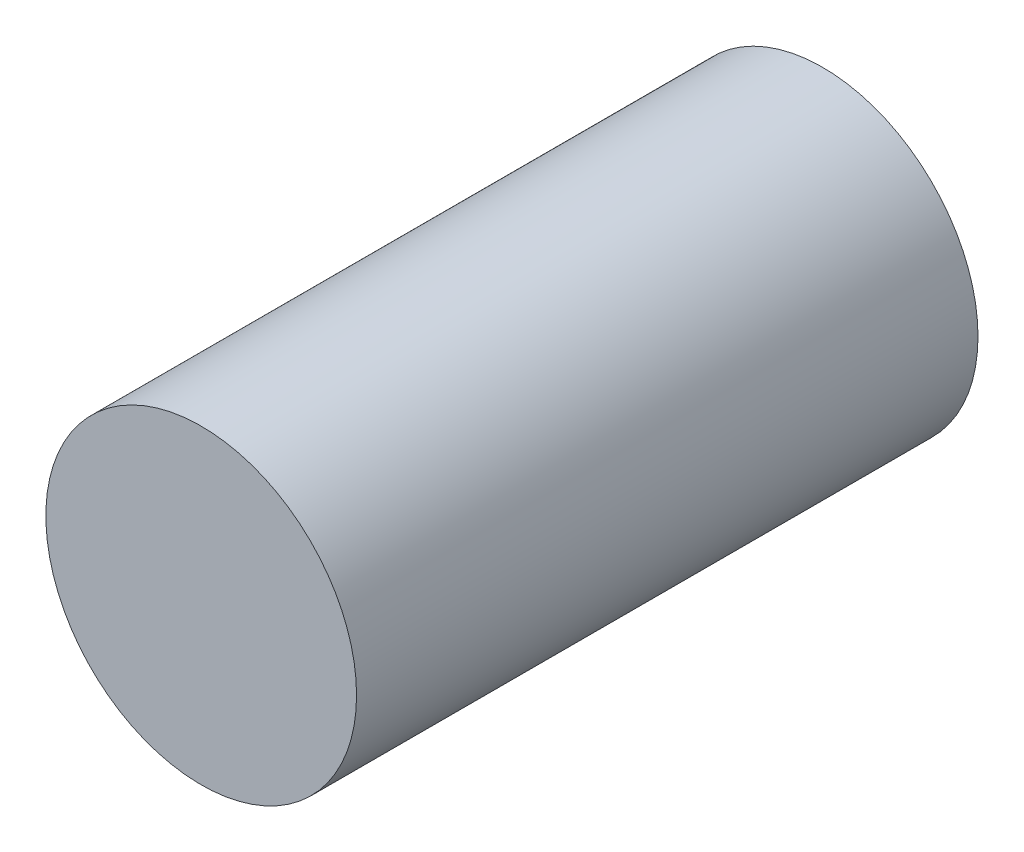
ISO-10303-21;
HEADER;
FILE_DESCRIPTION(('STEP AP214'),'2;1');
FILE_NAME('part.step','',(''),(''),'','','');
FILE_SCHEMA(('AUTOMOTIVE_DESIGN { 1 0 10303 214 1 1 1 1 }'));
ENDSEC;
DATA;
#1=APPLICATION_CONTEXT('core data for automotive mechanical design processes');
#2=APPLICATION_PROTOCOL_DEFINITION('international standard','automotive_design',2000,#1);
#3=PRODUCT_CONTEXT('',#1,'mechanical');
#4=PRODUCT('Part','Part','',(#3));
#5=PRODUCT_RELATED_PRODUCT_CATEGORY('part','',(#4));
#6=PRODUCT_DEFINITION_FORMATION('','',#4);
#7=PRODUCT_DEFINITION_CONTEXT('part definition',#1,'design');
#8=PRODUCT_DEFINITION('design','',#6,#7);
#9=PRODUCT_DEFINITION_SHAPE('','',#8);
#10=(LENGTH_UNIT() NAMED_UNIT(*) SI_UNIT(.MILLI.,.METRE.));
#11=(NAMED_UNIT(*) PLANE_ANGLE_UNIT() SI_UNIT($,.RADIAN.));
#12=(NAMED_UNIT(*) SI_UNIT($,.STERADIAN.) SOLID_ANGLE_UNIT());
#13=UNCERTAINTY_MEASURE_WITH_UNIT(LENGTH_MEASURE(1.E-05),#10,'distance_accuracy_value','');
#14=(GEOMETRIC_REPRESENTATION_CONTEXT(3) GLOBAL_UNCERTAINTY_ASSIGNED_CONTEXT((#13)) GLOBAL_UNIT_ASSIGNED_CONTEXT((#10,
#11,#12)) REPRESENTATION_CONTEXT('',''));
#15=CARTESIAN_POINT('',(0.,0.,0.));
#16=DIRECTION('',(0.,0.,1.));
#17=DIRECTION('',(1.,0.,0.));
#18=AXIS2_PLACEMENT_3D('',#15,#16,#17);
#19=CARTESIAN_POINT('',(0.,0.,16.));
#20=DIRECTION('',(0.,0.,-1.));
#21=DIRECTION('',(-1.,0.,0.));
#22=AXIS2_PLACEMENT_3D('',#19,#20,#21);
#23=CYLINDRICAL_SURFACE('',#22,4.);
#24=CARTESIAN_POINT('',(0.,0.,16.));
#25=DIRECTION('',(0.,0.,1.));
#26=DIRECTION('',(1.,0.,0.));
#27=AXIS2_PLACEMENT_3D('',#24,#25,#26);
#28=CIRCLE('',#27,4.);
#29=CARTESIAN_POINT('',(4.,0.,16.));
#30=VERTEX_POINT('',#29);
#31=EDGE_CURVE('E10',#30,#30,#28,.T.);
#32=ORIENTED_EDGE('',*,*,#31,.F.);
#33=EDGE_LOOP('',(#32));
#34=FACE_BOUND('',#33,.T.);
#35=CARTESIAN_POINT('',(0.,0.,0.));
#36=DIRECTION('',(0.,0.,1.));
#37=DIRECTION('',(1.,0.,0.));
#38=AXIS2_PLACEMENT_3D('',#35,#36,#37);
#39=CIRCLE('',#38,4.);
#40=CARTESIAN_POINT('',(4.,0.,0.));
#41=VERTEX_POINT('',#40);
#42=EDGE_CURVE('E37',#41,#41,#39,.T.);
#43=ORIENTED_EDGE('',*,*,#42,.T.);
#44=EDGE_LOOP('',(#43));
#45=FACE_BOUND('',#44,.T.);
#46=ADVANCED_FACE('F34',(#34,#45),#23,.T.);
#47=CARTESIAN_POINT('',(0.,0.,16.));
#48=DIRECTION('',(0.,0.,1.));
#49=DIRECTION('',(1.,0.,0.));
#50=AXIS2_PLACEMENT_3D('',#47,#48,#49);
#51=PLANE('',#50);
#52=ORIENTED_EDGE('',*,*,#31,.T.);
#53=EDGE_LOOP('',(#52));
#54=FACE_BOUND('',#53,.T.);
#55=ADVANCED_FACE('F49',(#54),#51,.T.);
#56=CARTESIAN_POINT('',(0.,0.,0.));
#57=DIRECTION('',(0.,0.,1.));
#58=DIRECTION('',(1.,0.,0.));
#59=AXIS2_PLACEMENT_3D('',#56,#57,#58);
#60=PLANE('',#59);
#61=ORIENTED_EDGE('',*,*,#42,.F.);
#62=EDGE_LOOP('',(#61));
#63=FACE_BOUND('',#62,.T.);
#64=ADVANCED_FACE('F47',(#63),#60,.F.);
#65=CLOSED_SHELL('',(#46,#55,#64));
#66=MANIFOLD_SOLID_BREP('B2',#65);
#67=ADVANCED_BREP_SHAPE_REPRESENTATION('',(#18,#66),#14);
#68=SHAPE_DEFINITION_REPRESENTATION(#9,#67);
ENDSEC;
END-ISO-10303-21;
